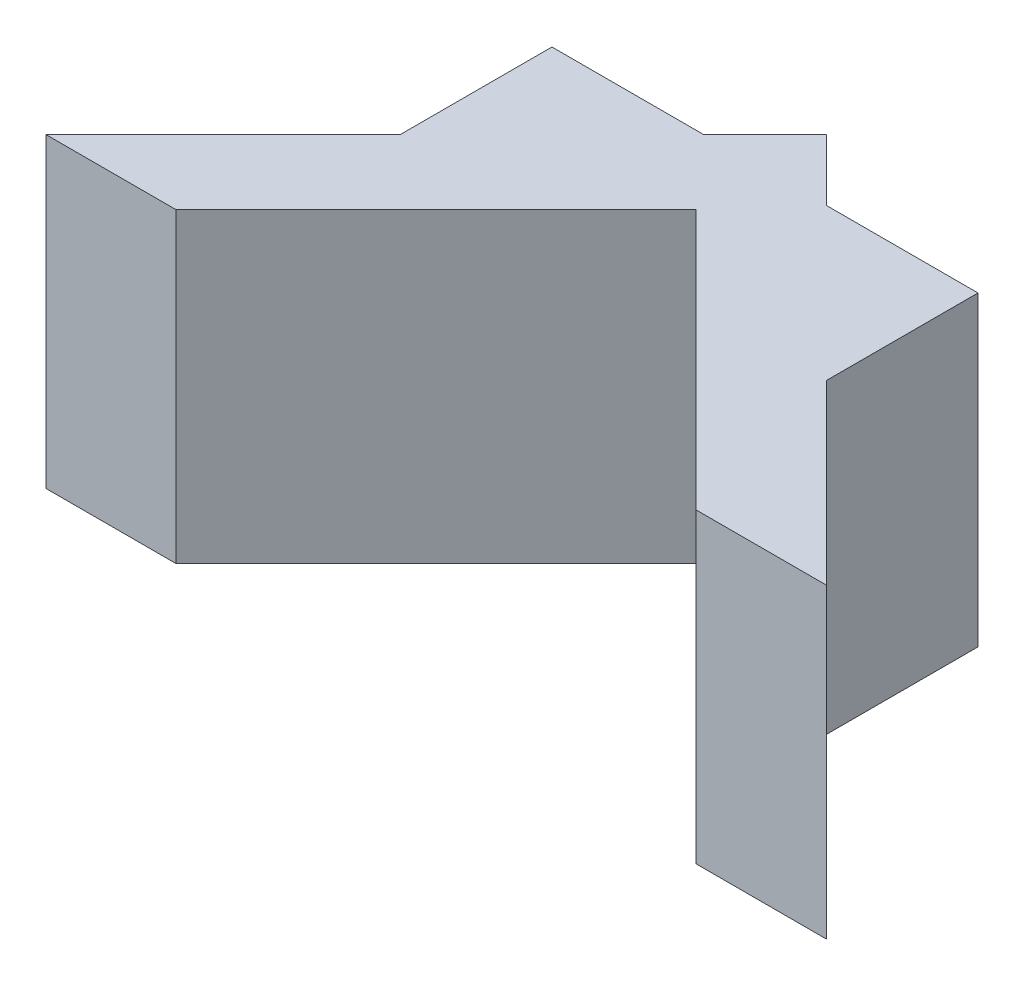
ISO-10303-21;
HEADER;
FILE_DESCRIPTION(('STEP AP214'),'2;1');
FILE_NAME('part.step','',(''),(''),'','','');
FILE_SCHEMA(('AUTOMOTIVE_DESIGN { 1 0 10303 214 1 1 1 1 }'));
ENDSEC;
DATA;
#1=APPLICATION_CONTEXT('core data for automotive mechanical design processes');
#2=APPLICATION_PROTOCOL_DEFINITION('international standard','automotive_design',2000,#1);
#3=PRODUCT_CONTEXT('',#1,'mechanical');
#4=PRODUCT('Part','Part','',(#3));
#5=PRODUCT_RELATED_PRODUCT_CATEGORY('part','',(#4));
#6=PRODUCT_DEFINITION_FORMATION('','',#4);
#7=PRODUCT_DEFINITION_CONTEXT('part definition',#1,'design');
#8=PRODUCT_DEFINITION('design','',#6,#7);
#9=PRODUCT_DEFINITION_SHAPE('','',#8);
#10=(LENGTH_UNIT() NAMED_UNIT(*) SI_UNIT(.MILLI.,.METRE.));
#11=(NAMED_UNIT(*) PLANE_ANGLE_UNIT() SI_UNIT($,.RADIAN.));
#12=(NAMED_UNIT(*) SI_UNIT($,.STERADIAN.) SOLID_ANGLE_UNIT());
#13=UNCERTAINTY_MEASURE_WITH_UNIT(LENGTH_MEASURE(1.E-05),#10,'distance_accuracy_value','');
#14=(GEOMETRIC_REPRESENTATION_CONTEXT(3) GLOBAL_UNCERTAINTY_ASSIGNED_CONTEXT((#13)) GLOBAL_UNIT_ASSIGNED_CONTEXT((#10,
#11,#12)) REPRESENTATION_CONTEXT('',''));
#15=CARTESIAN_POINT('',(0.,0.,0.));
#16=DIRECTION('',(0.,0.,1.));
#17=DIRECTION('',(1.,0.,0.));
#18=AXIS2_PLACEMENT_3D('',#15,#16,#17);
#19=CARTESIAN_POINT('',(-19.0918830920367,12.5,11.427149965576));
#20=DIRECTION('',(0.707106781186551,0.,0.707106781186544));
#21=DIRECTION('',(0.707106781186544,0.,-0.707106781186551));
#22=AXIS2_PLACEMENT_3D('',#19,#20,#21);
#23=PLANE('',#22);
#24=DIRECTION('',(0.,1.,0.));
#25=VECTOR('',#24,1.);
#26=CARTESIAN_POINT('',(-10.4246212024587,-13.,2.75988807599778));
#27=LINE('',#26,#25);
#28=CARTESIAN_POINT('',(-10.4246212024587,-2.5,2.75988807599778));
#29=VERTEX_POINT('',#28);
#30=CARTESIAN_POINT('',(-10.4246212024587,12.5,2.75988807599783));
#31=VERTEX_POINT('',#30);
#32=EDGE_CURVE('E246',#29,#31,#27,.T.);
#33=ORIENTED_EDGE('',*,*,#32,.F.);
#34=DIRECTION('',(-0.707106781186544,0.,0.707106781186551));
#35=VECTOR('',#34,1.);
#36=CARTESIAN_POINT('',(-19.0918830920367,-2.5,11.427149965576));
#37=LINE('',#36,#35);
#38=CARTESIAN_POINT('',(-19.0918830920367,-2.5,11.427149965576));
#39=VERTEX_POINT('',#38);
#40=EDGE_CURVE('E307',#29,#39,#37,.T.);
#41=ORIENTED_EDGE('',*,*,#40,.T.);
#42=DIRECTION('',(0.,-1.,0.));
#43=VECTOR('',#42,1.);
#44=CARTESIAN_POINT('',(-19.0918830920367,12.5,11.427149965576));
#45=LINE('',#44,#43);
#46=CARTESIAN_POINT('',(-19.0918830920367,12.5,11.427149965576));
#47=VERTEX_POINT('',#46);
#48=EDGE_CURVE('E313',#47,#39,#45,.T.);
#49=ORIENTED_EDGE('',*,*,#48,.F.);
#50=DIRECTION('',(-0.707106781186544,0.,0.707106781186551));
#51=VECTOR('',#50,1.);
#52=CARTESIAN_POINT('',(-19.0918830920367,12.5,11.427149965576));
#53=LINE('',#52,#51);
#54=EDGE_CURVE('E291',#31,#47,#53,.T.);
#55=ORIENTED_EDGE('',*,*,#54,.F.);
#56=EDGE_LOOP('',(#33,#41,#49,#55));
#57=FACE_BOUND('',#56,.T.);
#58=ADVANCED_FACE('F35',(#57),#23,.F.);
#59=DIRECTION('',(0.,1.,0.));
#60=VECTOR('',#59,1.);
#61=CARTESIAN_POINT('',(-2.99999999999999,-13.,-4.66473312646097));
#62=LINE('',#61,#60);
#63=CARTESIAN_POINT('',(-2.99999999999999,-2.5,-4.66473312646095));
#64=VERTEX_POINT('',#63);
#65=CARTESIAN_POINT('',(-2.99999999999999,12.5,-4.66473312646095));
#66=VERTEX_POINT('',#65);
#67=EDGE_CURVE('E243',#64,#66,#62,.T.);
#68=ORIENTED_EDGE('',*,*,#67,.T.);
#69=CARTESIAN_POINT('',(0.,12.5,-7.66473312646099));
#70=VERTEX_POINT('',#69);
#71=EDGE_CURVE('E292',#70,#66,#53,.T.);
#72=ORIENTED_EDGE('',*,*,#71,.F.);
#73=DIRECTION('',(0.,-1.,0.));
#74=VECTOR('',#73,1.);
#75=CARTESIAN_POINT('',(0.,12.5,-7.66473312646099));
#76=LINE('',#75,#74);
#77=CARTESIAN_POINT('',(0.,-2.5,-7.66473312646099));
#78=VERTEX_POINT('',#77);
#79=EDGE_CURVE('E316',#70,#78,#76,.T.);
#80=ORIENTED_EDGE('',*,*,#79,.T.);
#81=EDGE_CURVE('E308',#78,#64,#37,.T.);
#82=ORIENTED_EDGE('',*,*,#81,.T.);
#83=EDGE_LOOP('',(#68,#72,#80,#82));
#84=FACE_BOUND('',#83,.T.);
#85=ADVANCED_FACE('F355',(#84),#23,.F.);
#86=CARTESIAN_POINT('',(0.,12.5,-7.66473312646099));
#87=DIRECTION('',(-0.707106781186547,0.,0.707106781186548));
#88=DIRECTION('',(0.707106781186548,0.,0.707106781186547));
#89=AXIS2_PLACEMENT_3D('',#86,#87,#88);
#90=PLANE('',#89);
#91=DIRECTION('',(0.,1.,0.));
#92=VECTOR('',#91,1.);
#93=CARTESIAN_POINT('',(3.00000000000001,-13.,-4.66473312646097));
#94=LINE('',#93,#92);
#95=CARTESIAN_POINT('',(3.00000000000001,-2.5,-4.66473312646097));
#96=VERTEX_POINT('',#95);
#97=CARTESIAN_POINT('',(3.00000000000002,12.5,-4.66473312646098));
#98=VERTEX_POINT('',#97);
#99=EDGE_CURVE('E273',#96,#98,#94,.T.);
#100=ORIENTED_EDGE('',*,*,#99,.F.);
#101=DIRECTION('',(-0.707106781186548,0.,-0.707106781186547));
#102=VECTOR('',#101,1.);
#103=CARTESIAN_POINT('',(0.,-2.5,-7.66473312646099));
#104=LINE('',#103,#102);
#105=EDGE_CURVE('E304',#96,#78,#104,.T.);
#106=ORIENTED_EDGE('',*,*,#105,.T.);
#107=ORIENTED_EDGE('',*,*,#79,.F.);
#108=DIRECTION('',(-0.707106781186548,0.,-0.707106781186547));
#109=VECTOR('',#108,1.);
#110=CARTESIAN_POINT('',(0.,12.5,-7.66473312646099));
#111=LINE('',#110,#109);
#112=EDGE_CURVE('E287',#98,#70,#111,.T.);
#113=ORIENTED_EDGE('',*,*,#112,.F.);
#114=EDGE_LOOP('',(#100,#106,#107,#113));
#115=FACE_BOUND('',#114,.T.);
#116=ADVANCED_FACE('F352',(#115),#90,.F.);
#117=DIRECTION('',(0.,1.,0.));
#118=VECTOR('',#117,1.);
#119=CARTESIAN_POINT('',(10.4246212024588,-13.,2.75988807599778));
#120=LINE('',#119,#118);
#121=CARTESIAN_POINT('',(10.4246212024588,-2.5,2.75988807599777));
#122=VERTEX_POINT('',#121);
#123=CARTESIAN_POINT('',(10.4246212024588,12.5,2.75988807599777));
#124=VERTEX_POINT('',#123);
#125=EDGE_CURVE('E276',#122,#124,#120,.T.);
#126=ORIENTED_EDGE('',*,*,#125,.T.);
#127=CARTESIAN_POINT('',(19.0918830920368,12.5,11.4271499655758));
#128=VERTEX_POINT('',#127);
#129=EDGE_CURVE('E288',#128,#124,#111,.T.);
#130=ORIENTED_EDGE('',*,*,#129,.F.);
#131=DIRECTION('',(0.,-1.,0.));
#132=VECTOR('',#131,1.);
#133=CARTESIAN_POINT('',(19.0918830920368,12.5,11.4271499655758));
#134=LINE('',#133,#132);
#135=CARTESIAN_POINT('',(19.0918830920368,-2.5,11.4271499655758));
#136=VERTEX_POINT('',#135);
#137=EDGE_CURVE('E319',#128,#136,#134,.T.);
#138=ORIENTED_EDGE('',*,*,#137,.T.);
#139=EDGE_CURVE('E305',#136,#122,#104,.T.);
#140=ORIENTED_EDGE('',*,*,#139,.T.);
#141=EDGE_LOOP('',(#126,#130,#138,#140));
#142=FACE_BOUND('',#141,.T.);
#143=ADVANCED_FACE('F336',(#142),#90,.F.);
#144=CARTESIAN_POINT('',(0.,12.5,-1.300772095782));
#145=DIRECTION('',(-0.707106781186549,0.,-0.707106781186546));
#146=DIRECTION('',(-0.707106781186546,0.,0.707106781186549));
#147=AXIS2_PLACEMENT_3D('',#144,#145,#146);
#148=PLANE('',#147);
#149=DIRECTION('',(0.707106781186546,0.,-0.707106781186549));
#150=VECTOR('',#149,1.);
#151=CARTESIAN_POINT('',(0.,-2.5,-1.300772095782));
#152=LINE('',#151,#150);
#153=CARTESIAN_POINT('',(-12.7279220613579,-2.5,11.4271499655759));
#154=VERTEX_POINT('',#153);
#155=CARTESIAN_POINT('',(0.,-2.5,-1.300772095782));
#156=VERTEX_POINT('',#155);
#157=EDGE_CURVE('E267',#154,#156,#152,.T.);
#158=ORIENTED_EDGE('',*,*,#157,.T.);
#159=DIRECTION('',(0.,-1.,0.));
#160=VECTOR('',#159,1.);
#161=CARTESIAN_POINT('',(0.,12.5,-1.300772095782));
#162=LINE('',#161,#160);
#163=CARTESIAN_POINT('',(0.,12.5,-1.300772095782));
#164=VERTEX_POINT('',#163);
#165=EDGE_CURVE('E11',#164,#156,#162,.T.);
#166=ORIENTED_EDGE('',*,*,#165,.F.);
#167=DIRECTION('',(0.707106781186546,0.,-0.707106781186549));
#168=VECTOR('',#167,1.);
#169=CARTESIAN_POINT('',(0.,12.5,-1.300772095782));
#170=LINE('',#169,#168);
#171=CARTESIAN_POINT('',(-12.7279220613579,12.5,11.4271499655759));
#172=VERTEX_POINT('',#171);
#173=EDGE_CURVE('E279',#172,#164,#170,.T.);
#174=ORIENTED_EDGE('',*,*,#173,.F.);
#175=DIRECTION('',(0.,-1.,0.));
#176=VECTOR('',#175,1.);
#177=CARTESIAN_POINT('',(-12.7279220613579,12.5,11.4271499655759));
#178=LINE('',#177,#176);
#179=EDGE_CURVE('E297',#172,#154,#178,.T.);
#180=ORIENTED_EDGE('',*,*,#179,.T.);
#181=EDGE_LOOP('',(#158,#166,#174,#180));
#182=FACE_BOUND('',#181,.T.);
#183=ADVANCED_FACE('F37',(#182),#148,.F.);
#184=CARTESIAN_POINT('',(12.7279220613578,12.5,11.4271499655758));
#185=DIRECTION('',(0.707106781186547,0.,-0.707106781186549));
#186=DIRECTION('',(-0.707106781186549,0.,-0.707106781186547));
#187=AXIS2_PLACEMENT_3D('',#184,#185,#186);
#188=PLANE('',#187);
#189=DIRECTION('',(0.707106781186549,0.,0.707106781186547));
#190=VECTOR('',#189,1.);
#191=CARTESIAN_POINT('',(12.7279220613578,-2.5,11.4271499655758));
#192=LINE('',#191,#190);
#193=CARTESIAN_POINT('',(12.7279220613578,-2.5,11.4271499655758));
#194=VERTEX_POINT('',#193);
#195=EDGE_CURVE('E300',#156,#194,#192,.T.);
#196=ORIENTED_EDGE('',*,*,#195,.T.);
#197=DIRECTION('',(0.,-1.,0.));
#198=VECTOR('',#197,1.);
#199=CARTESIAN_POINT('',(12.7279220613578,12.5,11.4271499655758));
#200=LINE('',#199,#198);
#201=CARTESIAN_POINT('',(12.7279220613578,12.5,11.4271499655758));
#202=VERTEX_POINT('',#201);
#203=EDGE_CURVE('E43',#202,#194,#200,.T.);
#204=ORIENTED_EDGE('',*,*,#203,.F.);
#205=DIRECTION('',(0.707106781186549,0.,0.707106781186547));
#206=VECTOR('',#205,1.);
#207=CARTESIAN_POINT('',(12.7279220613578,12.5,11.4271499655758));
#208=LINE('',#207,#206);
#209=EDGE_CURVE('E282',#164,#202,#208,.T.);
#210=ORIENTED_EDGE('',*,*,#209,.F.);
#211=ORIENTED_EDGE('',*,*,#165,.T.);
#212=EDGE_LOOP('',(#196,#204,#210,#211));
#213=FACE_BOUND('',#212,.T.);
#214=ADVANCED_FACE('F375',(#213),#188,.F.);
#215=CARTESIAN_POINT('',(19.0918830920368,12.5,11.4271499655758));
#216=DIRECTION('',(0.,0.,-1.));
#217=DIRECTION('',(-1.,0.,0.));
#218=AXIS2_PLACEMENT_3D('',#215,#216,#217);
#219=PLANE('',#218);
#220=DIRECTION('',(1.,0.,0.));
#221=VECTOR('',#220,1.);
#222=CARTESIAN_POINT('',(19.0918830920368,-2.5,11.4271499655758));
#223=LINE('',#222,#221);
#224=EDGE_CURVE('E302',#194,#136,#223,.T.);
#225=ORIENTED_EDGE('',*,*,#224,.T.);
#226=ORIENTED_EDGE('',*,*,#137,.F.);
#227=DIRECTION('',(1.,0.,0.));
#228=VECTOR('',#227,1.);
#229=CARTESIAN_POINT('',(19.0918830920368,12.5,11.4271499655758));
#230=LINE('',#229,#228);
#231=EDGE_CURVE('E285',#202,#128,#230,.T.);
#232=ORIENTED_EDGE('',*,*,#231,.F.);
#233=ORIENTED_EDGE('',*,*,#203,.T.);
#234=EDGE_LOOP('',(#225,#226,#232,#233));
#235=FACE_BOUND('',#234,.T.);
#236=ADVANCED_FACE('F326',(#235),#219,.F.);
#237=CARTESIAN_POINT('',(-19.0918830920367,12.5,11.427149965576));
#238=DIRECTION('',(0.,0.,-1.));
#239=DIRECTION('',(-1.,0.,0.));
#240=AXIS2_PLACEMENT_3D('',#237,#238,#239);
#241=PLANE('',#240);
#242=DIRECTION('',(1.,0.,0.));
#243=VECTOR('',#242,1.);
#244=CARTESIAN_POINT('',(-19.0918830920367,-2.5,11.427149965576));
#245=LINE('',#244,#243);
#246=EDGE_CURVE('E283',#39,#154,#245,.T.);
#247=ORIENTED_EDGE('',*,*,#246,.T.);
#248=ORIENTED_EDGE('',*,*,#179,.F.);
#249=DIRECTION('',(1.,0.,0.));
#250=VECTOR('',#249,1.);
#251=CARTESIAN_POINT('',(-19.0918830920367,12.5,11.427149965576));
#252=LINE('',#251,#250);
#253=EDGE_CURVE('E295',#47,#172,#252,.T.);
#254=ORIENTED_EDGE('',*,*,#253,.F.);
#255=ORIENTED_EDGE('',*,*,#48,.T.);
#256=EDGE_LOOP('',(#247,#248,#254,#255));
#257=FACE_BOUND('',#256,.T.);
#258=ADVANCED_FACE('F372',(#257),#241,.F.);
#259=CARTESIAN_POINT('',(0.,12.5,-1.300772095782));
#260=DIRECTION('',(0.,1.,0.));
#261=DIRECTION('',(0.,0.,1.));
#262=AXIS2_PLACEMENT_3D('',#259,#260,#261);
#263=PLANE('',#262);
#264=ORIENTED_EDGE('',*,*,#173,.T.);
#265=ORIENTED_EDGE('',*,*,#209,.T.);
#266=ORIENTED_EDGE('',*,*,#231,.T.);
#267=ORIENTED_EDGE('',*,*,#129,.T.);
#268=DIRECTION('',(0.,0.,1.));
#269=VECTOR('',#268,1.);
#270=CARTESIAN_POINT('',(10.4246212024588,12.5,-4.66473312646097));
#271=LINE('',#270,#269);
#272=CARTESIAN_POINT('',(10.4246212024588,12.5,-4.66473312646097));
#273=VERTEX_POINT('',#272);
#274=EDGE_CURVE('E270',#273,#124,#271,.T.);
#275=ORIENTED_EDGE('',*,*,#274,.F.);
#276=DIRECTION('',(1.,0.,0.));
#277=VECTOR('',#276,1.);
#278=CARTESIAN_POINT('',(3.00000000000001,12.5,-4.66473312646097));
#279=LINE('',#278,#277);
#280=EDGE_CURVE('E255',#98,#273,#279,.T.);
#281=ORIENTED_EDGE('',*,*,#280,.F.);
#282=ORIENTED_EDGE('',*,*,#112,.T.);
#283=ORIENTED_EDGE('',*,*,#71,.T.);
#284=DIRECTION('',(1.,0.,0.));
#285=VECTOR('',#284,1.);
#286=CARTESIAN_POINT('',(-10.4246212024587,12.5,-4.66473312646097));
#287=LINE('',#286,#285);
#288=CARTESIAN_POINT('',(-10.4246212024587,12.5,-4.66473312646097));
#289=VERTEX_POINT('',#288);
#290=EDGE_CURVE('E249',#289,#66,#287,.T.);
#291=ORIENTED_EDGE('',*,*,#290,.F.);
#292=DIRECTION('',(0.,0.,-1.));
#293=VECTOR('',#292,1.);
#294=CARTESIAN_POINT('',(-10.4246212024587,12.5,2.75988807599778));
#295=LINE('',#294,#293);
#296=EDGE_CURVE('E252',#31,#289,#295,.T.);
#297=ORIENTED_EDGE('',*,*,#296,.F.);
#298=ORIENTED_EDGE('',*,*,#54,.T.);
#299=ORIENTED_EDGE('',*,*,#253,.T.);
#300=EDGE_LOOP('',(#264,#265,#266,#267,#275,#281,#282,#283,#291,#297,#298,#299));
#301=FACE_BOUND('',#300,.T.);
#302=ADVANCED_FACE('F340',(#301),#263,.T.);
#303=CARTESIAN_POINT('',(0.,-2.5,-1.300772095782));
#304=DIRECTION('',(0.,1.,0.));
#305=DIRECTION('',(0.,0.,1.));
#306=AXIS2_PLACEMENT_3D('',#303,#304,#305);
#307=PLANE('',#306);
#308=ORIENTED_EDGE('',*,*,#157,.F.);
#309=ORIENTED_EDGE('',*,*,#246,.F.);
#310=ORIENTED_EDGE('',*,*,#40,.F.);
#311=DIRECTION('',(0.,0.,1.));
#312=VECTOR('',#311,1.);
#313=CARTESIAN_POINT('',(-10.4246212024587,-2.5,2.75988807599778));
#314=LINE('',#313,#312);
#315=CARTESIAN_POINT('',(-10.4246212024587,-2.5,-4.66473312646097));
#316=VERTEX_POINT('',#315);
#317=EDGE_CURVE('E235',#316,#29,#314,.T.);
#318=ORIENTED_EDGE('',*,*,#317,.F.);
#319=DIRECTION('',(-1.,0.,0.));
#320=VECTOR('',#319,1.);
#321=CARTESIAN_POINT('',(-10.4246212024587,-2.5,-4.66473312646097));
#322=LINE('',#321,#320);
#323=EDGE_CURVE('E244',#64,#316,#322,.T.);
#324=ORIENTED_EDGE('',*,*,#323,.F.);
#325=ORIENTED_EDGE('',*,*,#81,.F.);
#326=ORIENTED_EDGE('',*,*,#105,.F.);
#327=DIRECTION('',(-1.,0.,0.));
#328=VECTOR('',#327,1.);
#329=CARTESIAN_POINT('',(3.00000000000001,-2.5,-4.66473312646097));
#330=LINE('',#329,#328);
#331=CARTESIAN_POINT('',(10.4246212024588,-2.5,-4.66473312646097));
#332=VERTEX_POINT('',#331);
#333=EDGE_CURVE('E263',#332,#96,#330,.T.);
#334=ORIENTED_EDGE('',*,*,#333,.F.);
#335=DIRECTION('',(0.,0.,-1.));
#336=VECTOR('',#335,1.);
#337=CARTESIAN_POINT('',(10.4246212024588,-2.5,-4.66473312646097));
#338=LINE('',#337,#336);
#339=EDGE_CURVE('E260',#122,#332,#338,.T.);
#340=ORIENTED_EDGE('',*,*,#339,.F.);
#341=ORIENTED_EDGE('',*,*,#139,.F.);
#342=ORIENTED_EDGE('',*,*,#224,.F.);
#343=ORIENTED_EDGE('',*,*,#195,.F.);
#344=EDGE_LOOP('',(#308,#309,#310,#318,#324,#325,#326,#334,#340,#341,#342,#343));
#345=FACE_BOUND('',#344,.T.);
#346=ADVANCED_FACE('F332',(#345),#307,.F.);
#347=CARTESIAN_POINT('',(3.00000000000001,-13.,-4.66473312646097));
#348=DIRECTION('',(0.,0.,1.));
#349=DIRECTION('',(1.,0.,0.));
#350=AXIS2_PLACEMENT_3D('',#347,#348,#349);
#351=PLANE('',#350);
#352=DIRECTION('',(1.,0.,0.));
#353=VECTOR('',#352,1.);
#354=CARTESIAN_POINT('',(9.20999999999997,8.855,-4.66473312646097));
#355=LINE('',#354,#353);
#356=CARTESIAN_POINT('',(4.49999999999997,8.855,-4.66473312646097));
#357=VERTEX_POINT('',#356);
#358=CARTESIAN_POINT('',(9.20999999999997,8.855,-4.66473312646097));
#359=VERTEX_POINT('',#358);
#360=EDGE_CURVE('E225',#357,#359,#355,.T.);
#361=ORIENTED_EDGE('',*,*,#360,.F.);
#362=DIRECTION('',(0.,1.,0.));
#363=VECTOR('',#362,1.);
#364=CARTESIAN_POINT('',(4.49999999999997,8.855,-4.66473312646097));
#365=LINE('',#364,#363);
#366=CARTESIAN_POINT('',(4.49999999999997,1.145,-4.66473312646097));
#367=VERTEX_POINT('',#366);
#368=EDGE_CURVE('E58',#367,#357,#365,.T.);
#369=ORIENTED_EDGE('',*,*,#368,.F.);
#370=DIRECTION('',(-1.,0.,0.));
#371=VECTOR('',#370,1.);
#372=CARTESIAN_POINT('',(9.20999999999997,1.145,-4.66473312646097));
#373=LINE('',#372,#371);
#374=CARTESIAN_POINT('',(9.20999999999997,1.145,-4.66473312646097));
#375=VERTEX_POINT('',#374);
#376=EDGE_CURVE('E214',#375,#367,#373,.T.);
#377=ORIENTED_EDGE('',*,*,#376,.F.);
#378=DIRECTION('',(0.,-1.,0.));
#379=VECTOR('',#378,1.);
#380=CARTESIAN_POINT('',(9.20999999999997,8.855,-4.66473312646097));
#381=LINE('',#380,#379);
#382=EDGE_CURVE('E228',#359,#375,#381,.T.);
#383=ORIENTED_EDGE('',*,*,#382,.F.);
#384=EDGE_LOOP('',(#361,#369,#377,#383));
#385=FACE_BOUND('',#384,.T.);
#386=DIRECTION('',(0.,1.,0.));
#387=VECTOR('',#386,1.);
#388=CARTESIAN_POINT('',(10.4246212024588,-13.,-4.66473312646097));
#389=LINE('',#388,#387);
#390=EDGE_CURVE('E264',#332,#273,#389,.T.);
#391=ORIENTED_EDGE('',*,*,#390,.F.);
#392=ORIENTED_EDGE('',*,*,#333,.T.);
#393=ORIENTED_EDGE('',*,*,#99,.T.);
#394=ORIENTED_EDGE('',*,*,#280,.T.);
#395=EDGE_LOOP('',(#391,#392,#393,#394));
#396=FACE_BOUND('',#395,.T.);
#397=ADVANCED_FACE('F346',(#385,#396),#351,.F.);
#398=CARTESIAN_POINT('',(10.4246212024588,-13.,-4.66473312646097));
#399=DIRECTION('',(-1.,0.,0.));
#400=DIRECTION('',(0.,0.,1.));
#401=AXIS2_PLACEMENT_3D('',#398,#399,#400);
#402=PLANE('',#401);
#403=ORIENTED_EDGE('',*,*,#125,.F.);
#404=ORIENTED_EDGE('',*,*,#339,.T.);
#405=ORIENTED_EDGE('',*,*,#390,.T.);
#406=ORIENTED_EDGE('',*,*,#274,.T.);
#407=EDGE_LOOP('',(#403,#404,#405,#406));
#408=FACE_BOUND('',#407,.T.);
#409=ADVANCED_FACE('F343',(#408),#402,.F.);
#410=CARTESIAN_POINT('',(-10.4246212024587,-13.,2.75988807599778));
#411=DIRECTION('',(1.,0.,0.));
#412=DIRECTION('',(0.,0.,-1.));
#413=AXIS2_PLACEMENT_3D('',#410,#411,#412);
#414=PLANE('',#413);
#415=DIRECTION('',(0.,1.,0.));
#416=VECTOR('',#415,1.);
#417=CARTESIAN_POINT('',(-10.4246212024587,-13.,-4.66473312646097));
#418=LINE('',#417,#416);
#419=EDGE_CURVE('E241',#316,#289,#418,.T.);
#420=ORIENTED_EDGE('',*,*,#419,.F.);
#421=ORIENTED_EDGE('',*,*,#317,.T.);
#422=ORIENTED_EDGE('',*,*,#32,.T.);
#423=ORIENTED_EDGE('',*,*,#296,.T.);
#424=EDGE_LOOP('',(#420,#421,#422,#423));
#425=FACE_BOUND('',#424,.T.);
#426=ADVANCED_FACE('F363',(#425),#414,.F.);
#427=CARTESIAN_POINT('',(-10.4246212024587,-13.,-4.66473312646097));
#428=DIRECTION('',(0.,0.,1.));
#429=DIRECTION('',(1.,0.,0.));
#430=AXIS2_PLACEMENT_3D('',#427,#428,#429);
#431=PLANE('',#430);
#432=DIRECTION('',(1.,0.,0.));
#433=VECTOR('',#432,1.);
#434=CARTESIAN_POINT('',(-4.50000000000003,8.855,-4.66473312646097));
#435=LINE('',#434,#433);
#436=CARTESIAN_POINT('',(-9.21000000000003,8.855,-4.66473312646097));
#437=VERTEX_POINT('',#436);
#438=CARTESIAN_POINT('',(-4.50000000000003,8.855,-4.66473312646097));
#439=VERTEX_POINT('',#438);
#440=EDGE_CURVE('E201',#437,#439,#435,.T.);
#441=ORIENTED_EDGE('',*,*,#440,.F.);
#442=DIRECTION('',(0.,1.,0.));
#443=VECTOR('',#442,1.);
#444=CARTESIAN_POINT('',(-9.21000000000003,8.855,-4.66473312646096));
#445=LINE('',#444,#443);
#446=CARTESIAN_POINT('',(-9.21000000000003,1.145,-4.66473312646096));
#447=VERTEX_POINT('',#446);
#448=EDGE_CURVE('E50',#447,#437,#445,.T.);
#449=ORIENTED_EDGE('',*,*,#448,.F.);
#450=DIRECTION('',(-1.,0.,0.));
#451=VECTOR('',#450,1.);
#452=CARTESIAN_POINT('',(-4.50000000000003,1.145,-4.66473312646097));
#453=LINE('',#452,#451);
#454=CARTESIAN_POINT('',(-4.50000000000003,1.145,-4.66473312646097));
#455=VERTEX_POINT('',#454);
#456=EDGE_CURVE('E192',#455,#447,#453,.T.);
#457=ORIENTED_EDGE('',*,*,#456,.F.);
#458=DIRECTION('',(0.,-1.,0.));
#459=VECTOR('',#458,1.);
#460=CARTESIAN_POINT('',(-4.50000000000003,8.855,-4.66473312646097));
#461=LINE('',#460,#459);
#462=EDGE_CURVE('E195',#439,#455,#461,.T.);
#463=ORIENTED_EDGE('',*,*,#462,.F.);
#464=EDGE_LOOP('',(#441,#449,#457,#463));
#465=FACE_BOUND('',#464,.T.);
#466=ORIENTED_EDGE('',*,*,#67,.F.);
#467=ORIENTED_EDGE('',*,*,#323,.T.);
#468=ORIENTED_EDGE('',*,*,#419,.T.);
#469=ORIENTED_EDGE('',*,*,#290,.T.);
#470=EDGE_LOOP('',(#466,#467,#468,#469));
#471=FACE_BOUND('',#470,.T.);
#472=ADVANCED_FACE('F359',(#465,#471),#431,.F.);
#473=CARTESIAN_POINT('',(4.49999999999997,8.855,-0.164733126460966));
#474=DIRECTION('',(-1.,0.,0.));
#475=DIRECTION('',(0.,0.,1.));
#476=AXIS2_PLACEMENT_3D('',#473,#474,#475);
#477=PLANE('',#476);
#478=ORIENTED_EDGE('',*,*,#368,.T.);
#479=DIRECTION('',(0.,0.,-1.));
#480=VECTOR('',#479,1.);
#481=CARTESIAN_POINT('',(4.49999999999997,8.855,-0.164733126460966));
#482=LINE('',#481,#480);
#483=CARTESIAN_POINT('',(4.49999999999997,8.855,-0.164733126460966));
#484=VERTEX_POINT('',#483);
#485=EDGE_CURVE('E223',#484,#357,#482,.T.);
#486=ORIENTED_EDGE('',*,*,#485,.F.);
#487=DIRECTION('',(0.,1.,0.));
#488=VECTOR('',#487,1.);
#489=CARTESIAN_POINT('',(4.49999999999997,8.855,-0.164733126460966));
#490=LINE('',#489,#488);
#491=CARTESIAN_POINT('',(4.49999999999997,1.145,-0.164733126460966));
#492=VERTEX_POINT('',#491);
#493=EDGE_CURVE('E210',#492,#484,#490,.T.);
#494=ORIENTED_EDGE('',*,*,#493,.F.);
#495=DIRECTION('',(0.,0.,-1.));
#496=VECTOR('',#495,1.);
#497=CARTESIAN_POINT('',(4.49999999999997,1.145,-0.164733126460966));
#498=LINE('',#497,#496);
#499=EDGE_CURVE('E233',#492,#367,#498,.T.);
#500=ORIENTED_EDGE('',*,*,#499,.T.);
#501=EDGE_LOOP('',(#478,#486,#494,#500));
#502=FACE_BOUND('',#501,.T.);
#503=ADVANCED_FACE('F469',(#502),#477,.F.);
#504=CARTESIAN_POINT('',(9.20999999999997,1.145,-0.164733126460967));
#505=DIRECTION('',(0.,-1.,0.));
#506=DIRECTION('',(0.,0.,-1.));
#507=AXIS2_PLACEMENT_3D('',#504,#505,#506);
#508=PLANE('',#507);
#509=ORIENTED_EDGE('',*,*,#376,.T.);
#510=ORIENTED_EDGE('',*,*,#499,.F.);
#511=DIRECTION('',(-1.,0.,0.));
#512=VECTOR('',#511,1.);
#513=CARTESIAN_POINT('',(9.20999999999997,1.145,-0.164733126460967));
#514=LINE('',#513,#512);
#515=CARTESIAN_POINT('',(9.20999999999997,1.145,-0.164733126460967));
#516=VERTEX_POINT('',#515);
#517=EDGE_CURVE('E220',#516,#492,#514,.T.);
#518=ORIENTED_EDGE('',*,*,#517,.F.);
#519=DIRECTION('',(0.,0.,-1.));
#520=VECTOR('',#519,1.);
#521=CARTESIAN_POINT('',(9.20999999999997,1.145,-0.164733126460967));
#522=LINE('',#521,#520);
#523=EDGE_CURVE('E236',#516,#375,#522,.T.);
#524=ORIENTED_EDGE('',*,*,#523,.T.);
#525=EDGE_LOOP('',(#509,#510,#518,#524));
#526=FACE_BOUND('',#525,.T.);
#527=ADVANCED_FACE('F479',(#526),#508,.F.);
#528=CARTESIAN_POINT('',(9.20999999999997,8.855,-0.164733126460967));
#529=DIRECTION('',(1.,0.,0.));
#530=DIRECTION('',(0.,0.,-1.));
#531=AXIS2_PLACEMENT_3D('',#528,#529,#530);
#532=PLANE('',#531);
#533=ORIENTED_EDGE('',*,*,#382,.T.);
#534=ORIENTED_EDGE('',*,*,#523,.F.);
#535=DIRECTION('',(0.,-1.,0.));
#536=VECTOR('',#535,1.);
#537=CARTESIAN_POINT('',(9.20999999999997,8.855,-0.164733126460967));
#538=LINE('',#537,#536);
#539=CARTESIAN_POINT('',(9.20999999999997,8.855,-0.164733126460967));
#540=VERTEX_POINT('',#539);
#541=EDGE_CURVE('E217',#540,#516,#538,.T.);
#542=ORIENTED_EDGE('',*,*,#541,.F.);
#543=DIRECTION('',(0.,0.,-1.));
#544=VECTOR('',#543,1.);
#545=CARTESIAN_POINT('',(9.20999999999997,8.855,-0.164733126460967));
#546=LINE('',#545,#544);
#547=EDGE_CURVE('E238',#540,#359,#546,.T.);
#548=ORIENTED_EDGE('',*,*,#547,.T.);
#549=EDGE_LOOP('',(#533,#534,#542,#548));
#550=FACE_BOUND('',#549,.T.);
#551=ADVANCED_FACE('F488',(#550),#532,.F.);
#552=CARTESIAN_POINT('',(9.20999999999997,8.855,-0.164733126460967));
#553=DIRECTION('',(0.,1.,0.));
#554=DIRECTION('',(-1.,0.,0.));
#555=AXIS2_PLACEMENT_3D('',#552,#553,#554);
#556=PLANE('',#555);
#557=ORIENTED_EDGE('',*,*,#360,.T.);
#558=ORIENTED_EDGE('',*,*,#547,.F.);
#559=DIRECTION('',(1.,0.,0.));
#560=VECTOR('',#559,1.);
#561=CARTESIAN_POINT('',(9.20999999999997,8.855,-0.164733126460967));
#562=LINE('',#561,#560);
#563=EDGE_CURVE('E213',#484,#540,#562,.T.);
#564=ORIENTED_EDGE('',*,*,#563,.F.);
#565=ORIENTED_EDGE('',*,*,#485,.T.);
#566=EDGE_LOOP('',(#557,#558,#564,#565));
#567=FACE_BOUND('',#566,.T.);
#568=ADVANCED_FACE('F498',(#567),#556,.F.);
#569=CARTESIAN_POINT('',(0.,-2.5,-0.164733126460965));
#570=DIRECTION('',(0.,0.,-1.));
#571=DIRECTION('',(-1.,0.,0.));
#572=AXIS2_PLACEMENT_3D('',#569,#570,#571);
#573=PLANE('',#572);
#574=ORIENTED_EDGE('',*,*,#493,.T.);
#575=ORIENTED_EDGE('',*,*,#563,.T.);
#576=ORIENTED_EDGE('',*,*,#541,.T.);
#577=ORIENTED_EDGE('',*,*,#517,.T.);
#578=EDGE_LOOP('',(#574,#575,#576,#577));
#579=FACE_BOUND('',#578,.T.);
#580=ADVANCED_FACE('F508',(#579),#573,.T.);
#581=CARTESIAN_POINT('',(-9.21000000000003,8.855,-0.164733126460964));
#582=DIRECTION('',(-1.,0.,0.));
#583=DIRECTION('',(0.,0.,1.));
#584=AXIS2_PLACEMENT_3D('',#581,#582,#583);
#585=PLANE('',#584);
#586=ORIENTED_EDGE('',*,*,#448,.T.);
#587=DIRECTION('',(0.,0.,-1.));
#588=VECTOR('',#587,1.);
#589=CARTESIAN_POINT('',(-9.21000000000003,8.855,-0.164733126460964));
#590=LINE('',#589,#588);
#591=CARTESIAN_POINT('',(-9.21000000000003,8.855,-0.164733126460964));
#592=VERTEX_POINT('',#591);
#593=EDGE_CURVE('E170',#592,#437,#590,.T.);
#594=ORIENTED_EDGE('',*,*,#593,.F.);
#595=DIRECTION('',(0.,1.,0.));
#596=VECTOR('',#595,1.);
#597=CARTESIAN_POINT('',(-9.21000000000003,8.855,-0.164733126460964));
#598=LINE('',#597,#596);
#599=CARTESIAN_POINT('',(-9.21000000000003,1.145,-0.164733126460964));
#600=VERTEX_POINT('',#599);
#601=EDGE_CURVE('E174',#600,#592,#598,.T.);
#602=ORIENTED_EDGE('',*,*,#601,.F.);
#603=DIRECTION('',(0.,0.,-1.));
#604=VECTOR('',#603,1.);
#605=CARTESIAN_POINT('',(-9.21000000000003,1.145,-0.164733126460964));
#606=LINE('',#605,#604);
#607=EDGE_CURVE('E205',#600,#447,#606,.T.);
#608=ORIENTED_EDGE('',*,*,#607,.T.);
#609=EDGE_LOOP('',(#586,#594,#602,#608));
#610=FACE_BOUND('',#609,.T.);
#611=ADVANCED_FACE('F172',(#610),#585,.F.);
#612=CARTESIAN_POINT('',(-4.50000000000003,1.145,-0.164733126460965));
#613=DIRECTION('',(0.,-1.,0.));
#614=DIRECTION('',(0.,0.,-1.));
#615=AXIS2_PLACEMENT_3D('',#612,#613,#614);
#616=PLANE('',#615);
#617=ORIENTED_EDGE('',*,*,#456,.T.);
#618=ORIENTED_EDGE('',*,*,#607,.F.);
#619=DIRECTION('',(-1.,0.,0.));
#620=VECTOR('',#619,1.);
#621=CARTESIAN_POINT('',(-4.50000000000003,1.145,-0.164733126460965));
#622=LINE('',#621,#620);
#623=CARTESIAN_POINT('',(-4.50000000000003,1.145,-0.164733126460965));
#624=VERTEX_POINT('',#623);
#625=EDGE_CURVE('E180',#624,#600,#622,.T.);
#626=ORIENTED_EDGE('',*,*,#625,.F.);
#627=DIRECTION('',(0.,0.,-1.));
#628=VECTOR('',#627,1.);
#629=CARTESIAN_POINT('',(-4.50000000000003,1.145,-0.164733126460965));
#630=LINE('',#629,#628);
#631=EDGE_CURVE('E207',#624,#455,#630,.T.);
#632=ORIENTED_EDGE('',*,*,#631,.T.);
#633=EDGE_LOOP('',(#617,#618,#626,#632));
#634=FACE_BOUND('',#633,.T.);
#635=ADVANCED_FACE('F527',(#634),#616,.F.);
#636=CARTESIAN_POINT('',(-4.50000000000003,8.855,-0.164733126460965));
#637=DIRECTION('',(1.,0.,0.));
#638=DIRECTION('',(0.,0.,-1.));
#639=AXIS2_PLACEMENT_3D('',#636,#637,#638);
#640=PLANE('',#639);
#641=ORIENTED_EDGE('',*,*,#462,.T.);
#642=ORIENTED_EDGE('',*,*,#631,.F.);
#643=DIRECTION('',(0.,-1.,0.));
#644=VECTOR('',#643,1.);
#645=CARTESIAN_POINT('',(-4.50000000000003,8.855,-0.164733126460965));
#646=LINE('',#645,#644);
#647=CARTESIAN_POINT('',(-4.50000000000003,8.855,-0.164733126460965));
#648=VERTEX_POINT('',#647);
#649=EDGE_CURVE('E188',#648,#624,#646,.T.);
#650=ORIENTED_EDGE('',*,*,#649,.F.);
#651=DIRECTION('',(0.,0.,-1.));
#652=VECTOR('',#651,1.);
#653=CARTESIAN_POINT('',(-4.50000000000003,8.855,-0.164733126460965));
#654=LINE('',#653,#652);
#655=EDGE_CURVE('E179',#648,#439,#654,.T.);
#656=ORIENTED_EDGE('',*,*,#655,.T.);
#657=EDGE_LOOP('',(#641,#642,#650,#656));
#658=FACE_BOUND('',#657,.T.);
#659=ADVANCED_FACE('F536',(#658),#640,.F.);
#660=CARTESIAN_POINT('',(-4.50000000000003,8.855,-0.164733126460965));
#661=DIRECTION('',(0.,1.,0.));
#662=DIRECTION('',(-1.,0.,0.));
#663=AXIS2_PLACEMENT_3D('',#660,#661,#662);
#664=PLANE('',#663);
#665=ORIENTED_EDGE('',*,*,#440,.T.);
#666=ORIENTED_EDGE('',*,*,#655,.F.);
#667=DIRECTION('',(1.,0.,0.));
#668=VECTOR('',#667,1.);
#669=CARTESIAN_POINT('',(-4.50000000000003,8.855,-0.164733126460965));
#670=LINE('',#669,#668);
#671=EDGE_CURVE('E183',#592,#648,#670,.T.);
#672=ORIENTED_EDGE('',*,*,#671,.F.);
#673=ORIENTED_EDGE('',*,*,#593,.T.);
#674=EDGE_LOOP('',(#665,#666,#672,#673));
#675=FACE_BOUND('',#674,.T.);
#676=ADVANCED_FACE('F184',(#675),#664,.F.);
#677=CARTESIAN_POINT('',(0.,-2.5,-0.164733126460966));
#678=DIRECTION('',(0.,0.,-1.));
#679=DIRECTION('',(-1.,0.,0.));
#680=AXIS2_PLACEMENT_3D('',#677,#678,#679);
#681=PLANE('',#680);
#682=ORIENTED_EDGE('',*,*,#601,.T.);
#683=ORIENTED_EDGE('',*,*,#671,.T.);
#684=ORIENTED_EDGE('',*,*,#649,.T.);
#685=ORIENTED_EDGE('',*,*,#625,.T.);
#686=EDGE_LOOP('',(#682,#683,#684,#685));
#687=FACE_BOUND('',#686,.T.);
#688=ADVANCED_FACE('F190',(#687),#681,.T.);
#689=CLOSED_SHELL('',(#58,#85,#116,#143,#183,#214,#236,#258,#302,#346,#397,#409,#426,#472,#503,
#527,#551,#568,#580,#611,#635,#659,#676,#688));
#690=MANIFOLD_SOLID_BREP('B2',#689);
#691=ADVANCED_BREP_SHAPE_REPRESENTATION('',(#18,#690),#14);
#692=SHAPE_DEFINITION_REPRESENTATION(#9,#691);
ENDSEC;
END-ISO-10303-21;
